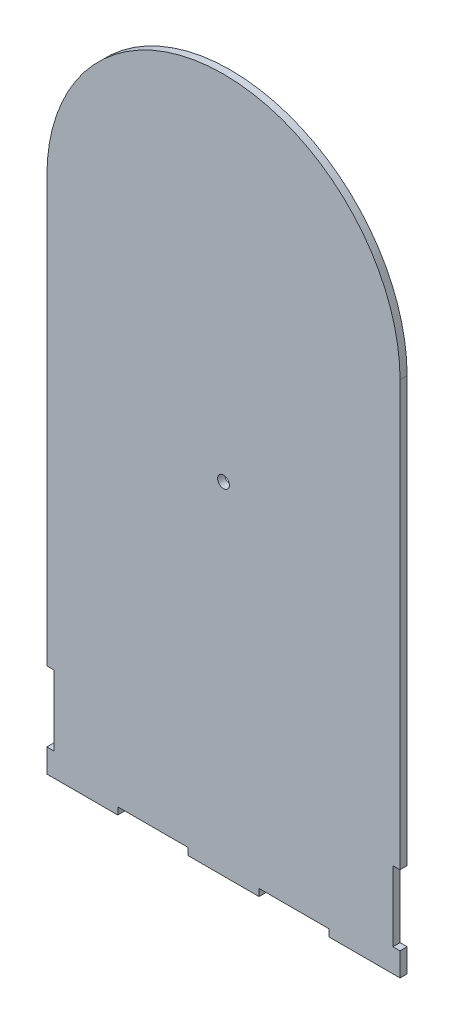
ISO-10303-21;
HEADER;
FILE_DESCRIPTION(('STEP AP214'),'2;1');
FILE_NAME('part.step','',(''),(''),'','','');
FILE_SCHEMA(('AUTOMOTIVE_DESIGN { 1 0 10303 214 1 1 1 1 }'));
ENDSEC;
DATA;
#1=APPLICATION_CONTEXT('core data for automotive mechanical design processes');
#2=APPLICATION_PROTOCOL_DEFINITION('international standard','automotive_design',2000,#1);
#3=PRODUCT_CONTEXT('',#1,'mechanical');
#4=PRODUCT('Part','Part','',(#3));
#5=PRODUCT_RELATED_PRODUCT_CATEGORY('part','',(#4));
#6=PRODUCT_DEFINITION_FORMATION('','',#4);
#7=PRODUCT_DEFINITION_CONTEXT('part definition',#1,'design');
#8=PRODUCT_DEFINITION('design','',#6,#7);
#9=PRODUCT_DEFINITION_SHAPE('','',#8);
#10=(LENGTH_UNIT() NAMED_UNIT(*) SI_UNIT(.MILLI.,.METRE.));
#11=(NAMED_UNIT(*) PLANE_ANGLE_UNIT() SI_UNIT($,.RADIAN.));
#12=(NAMED_UNIT(*) SI_UNIT($,.STERADIAN.) SOLID_ANGLE_UNIT());
#13=UNCERTAINTY_MEASURE_WITH_UNIT(LENGTH_MEASURE(1.E-05),#10,'distance_accuracy_value','');
#14=(GEOMETRIC_REPRESENTATION_CONTEXT(3) GLOBAL_UNCERTAINTY_ASSIGNED_CONTEXT((#13)) GLOBAL_UNIT_ASSIGNED_CONTEXT((#10,
#11,#12)) REPRESENTATION_CONTEXT('',''));
#15=CARTESIAN_POINT('',(0.,0.,0.));
#16=DIRECTION('',(0.,0.,1.));
#17=DIRECTION('',(1.,0.,0.));
#18=AXIS2_PLACEMENT_3D('',#15,#16,#17);
#19=CARTESIAN_POINT('',(150.,0.,3.));
#20=DIRECTION('',(-1.,0.,0.));
#21=DIRECTION('',(0.,-1.,0.));
#22=AXIS2_PLACEMENT_3D('',#19,#20,#21);
#23=PLANE('',#22);
#24=DIRECTION('',(0.,1.,0.));
#25=VECTOR('',#24,1.);
#26=CARTESIAN_POINT('',(150.,0.,0.));
#27=LINE('',#26,#25);
#28=CARTESIAN_POINT('',(150.,39.8,0.));
#29=VERTEX_POINT('',#28);
#30=CARTESIAN_POINT('',(150.,220.,0.));
#31=VERTEX_POINT('',#30);
#32=EDGE_CURVE('E221',#29,#31,#27,.T.);
#33=ORIENTED_EDGE('',*,*,#32,.T.);
#34=DIRECTION('',(0.,0.,-1.));
#35=VECTOR('',#34,1.);
#36=CARTESIAN_POINT('',(150.,220.,3.));
#37=LINE('',#36,#35);
#38=CARTESIAN_POINT('',(150.,220.,3.));
#39=VERTEX_POINT('',#38);
#40=EDGE_CURVE('E11',#39,#31,#37,.T.);
#41=ORIENTED_EDGE('',*,*,#40,.F.);
#42=DIRECTION('',(0.,1.,0.));
#43=VECTOR('',#42,1.);
#44=CARTESIAN_POINT('',(150.,0.,3.));
#45=LINE('',#44,#43);
#46=CARTESIAN_POINT('',(150.,39.8,3.));
#47=VERTEX_POINT('',#46);
#48=EDGE_CURVE('E287',#47,#39,#45,.T.);
#49=ORIENTED_EDGE('',*,*,#48,.F.);
#50=DIRECTION('',(0.,0.,-1.));
#51=VECTOR('',#50,1.);
#52=CARTESIAN_POINT('',(150.,39.8,3.));
#53=LINE('',#52,#51);
#54=EDGE_CURVE('E59',#47,#29,#53,.T.);
#55=ORIENTED_EDGE('',*,*,#54,.T.);
#56=EDGE_LOOP('',(#33,#41,#49,#55));
#57=FACE_BOUND('',#56,.T.);
#58=ADVANCED_FACE('F41',(#57),#23,.F.);
#59=CARTESIAN_POINT('',(75.,220.,3.));
#60=DIRECTION('',(0.,0.,-1.));
#61=DIRECTION('',(-1.,0.,0.));
#62=AXIS2_PLACEMENT_3D('',#59,#60,#61);
#63=CYLINDRICAL_SURFACE('',#62,75.);
#64=CARTESIAN_POINT('',(75.,220.,0.));
#65=DIRECTION('',(0.,0.,1.));
#66=DIRECTION('',(1.,0.,0.));
#67=AXIS2_PLACEMENT_3D('',#64,#65,#66);
#68=CIRCLE('',#67,75.);
#69=CARTESIAN_POINT('',(0.,220.,0.));
#70=VERTEX_POINT('',#69);
#71=EDGE_CURVE('E224',#31,#70,#68,.T.);
#72=ORIENTED_EDGE('',*,*,#71,.T.);
#73=DIRECTION('',(0.,0.,-1.));
#74=VECTOR('',#73,1.);
#75=CARTESIAN_POINT('',(0.,220.,3.));
#76=LINE('',#75,#74);
#77=CARTESIAN_POINT('',(0.,220.,3.));
#78=VERTEX_POINT('',#77);
#79=EDGE_CURVE('E51',#78,#70,#76,.T.);
#80=ORIENTED_EDGE('',*,*,#79,.F.);
#81=CARTESIAN_POINT('',(75.,220.,3.));
#82=DIRECTION('',(0.,0.,1.));
#83=DIRECTION('',(1.,0.,0.));
#84=AXIS2_PLACEMENT_3D('',#81,#82,#83);
#85=CIRCLE('',#84,75.);
#86=EDGE_CURVE('E133',#39,#78,#85,.T.);
#87=ORIENTED_EDGE('',*,*,#86,.F.);
#88=ORIENTED_EDGE('',*,*,#40,.T.);
#89=EDGE_LOOP('',(#72,#80,#87,#88));
#90=FACE_BOUND('',#89,.T.);
#91=ADVANCED_FACE('F43',(#90),#63,.T.);
#92=CARTESIAN_POINT('',(0.,0.,3.));
#93=DIRECTION('',(-1.,0.,0.));
#94=DIRECTION('',(0.,-1.,0.));
#95=AXIS2_PLACEMENT_3D('',#92,#93,#94);
#96=PLANE('',#95);
#97=DIRECTION('',(0.,1.,0.));
#98=VECTOR('',#97,1.);
#99=CARTESIAN_POINT('',(0.,0.,0.));
#100=LINE('',#99,#98);
#101=CARTESIAN_POINT('',(0.,39.8,0.));
#102=VERTEX_POINT('',#101);
#103=EDGE_CURVE('E229',#102,#70,#100,.T.);
#104=ORIENTED_EDGE('',*,*,#103,.F.);
#105=DIRECTION('',(0.,0.,-1.));
#106=VECTOR('',#105,1.);
#107=CARTESIAN_POINT('',(0.,39.8,3.));
#108=LINE('',#107,#106);
#109=CARTESIAN_POINT('',(0.,39.8,3.));
#110=VERTEX_POINT('',#109);
#111=EDGE_CURVE('E339',#110,#102,#108,.T.);
#112=ORIENTED_EDGE('',*,*,#111,.F.);
#113=DIRECTION('',(0.,1.,0.));
#114=VECTOR('',#113,1.);
#115=CARTESIAN_POINT('',(0.,0.,3.));
#116=LINE('',#115,#114);
#117=EDGE_CURVE('E347',#110,#78,#116,.T.);
#118=ORIENTED_EDGE('',*,*,#117,.T.);
#119=ORIENTED_EDGE('',*,*,#79,.T.);
#120=EDGE_LOOP('',(#104,#112,#118,#119));
#121=FACE_BOUND('',#120,.T.);
#122=ADVANCED_FACE('F345',(#121),#96,.T.);
#123=CARTESIAN_POINT('',(0.,39.8,3.));
#124=DIRECTION('',(0.,1.,0.));
#125=DIRECTION('',(0.,0.,1.));
#126=AXIS2_PLACEMENT_3D('',#123,#124,#125);
#127=PLANE('',#126);
#128=DIRECTION('',(1.,0.,0.));
#129=VECTOR('',#128,1.);
#130=CARTESIAN_POINT('',(0.,39.8,0.));
#131=LINE('',#130,#129);
#132=CARTESIAN_POINT('',(2.99999999999998,39.8,0.));
#133=VERTEX_POINT('',#132);
#134=EDGE_CURVE('E233',#102,#133,#131,.T.);
#135=ORIENTED_EDGE('',*,*,#134,.T.);
#136=DIRECTION('',(0.,0.,-1.));
#137=VECTOR('',#136,1.);
#138=CARTESIAN_POINT('',(2.99999999999998,39.8,3.));
#139=LINE('',#138,#137);
#140=CARTESIAN_POINT('',(2.99999999999998,39.8,3.));
#141=VERTEX_POINT('',#140);
#142=EDGE_CURVE('E335',#141,#133,#139,.T.);
#143=ORIENTED_EDGE('',*,*,#142,.F.);
#144=DIRECTION('',(1.,0.,0.));
#145=VECTOR('',#144,1.);
#146=CARTESIAN_POINT('',(0.,39.8,3.));
#147=LINE('',#146,#145);
#148=EDGE_CURVE('E367',#110,#141,#147,.T.);
#149=ORIENTED_EDGE('',*,*,#148,.F.);
#150=ORIENTED_EDGE('',*,*,#111,.T.);
#151=EDGE_LOOP('',(#135,#143,#149,#150));
#152=FACE_BOUND('',#151,.T.);
#153=ADVANCED_FACE('F356',(#152),#127,.F.);
#154=CARTESIAN_POINT('',(3.00000000000001,0.,3.));
#155=DIRECTION('',(1.,0.,0.));
#156=DIRECTION('',(0.,1.,0.));
#157=AXIS2_PLACEMENT_3D('',#154,#155,#156);
#158=PLANE('',#157);
#159=DIRECTION('',(0.,-1.,0.));
#160=VECTOR('',#159,1.);
#161=CARTESIAN_POINT('',(3.00000000000001,0.,0.));
#162=LINE('',#161,#160);
#163=CARTESIAN_POINT('',(3.,10.,0.));
#164=VERTEX_POINT('',#163);
#165=EDGE_CURVE('E237',#133,#164,#162,.T.);
#166=ORIENTED_EDGE('',*,*,#165,.T.);
#167=DIRECTION('',(0.,0.,-1.));
#168=VECTOR('',#167,1.);
#169=CARTESIAN_POINT('',(3.,10.,3.));
#170=LINE('',#169,#168);
#171=CARTESIAN_POINT('',(3.,10.,3.));
#172=VERTEX_POINT('',#171);
#173=EDGE_CURVE('E332',#172,#164,#170,.T.);
#174=ORIENTED_EDGE('',*,*,#173,.F.);
#175=DIRECTION('',(0.,-1.,0.));
#176=VECTOR('',#175,1.);
#177=CARTESIAN_POINT('',(3.00000000000001,0.,3.));
#178=LINE('',#177,#176);
#179=EDGE_CURVE('E362',#141,#172,#178,.T.);
#180=ORIENTED_EDGE('',*,*,#179,.F.);
#181=ORIENTED_EDGE('',*,*,#142,.T.);
#182=EDGE_LOOP('',(#166,#174,#180,#181));
#183=FACE_BOUND('',#182,.T.);
#184=ADVANCED_FACE('F360',(#183),#158,.F.);
#185=CARTESIAN_POINT('',(0.,9.99999999999999,3.));
#186=DIRECTION('',(0.,1.,0.));
#187=DIRECTION('',(-1.,0.,0.));
#188=AXIS2_PLACEMENT_3D('',#185,#186,#187);
#189=PLANE('',#188);
#190=DIRECTION('',(1.,0.,0.));
#191=VECTOR('',#190,1.);
#192=CARTESIAN_POINT('',(0.,9.99999999999999,0.));
#193=LINE('',#192,#191);
#194=CARTESIAN_POINT('',(0.,10.,0.));
#195=VERTEX_POINT('',#194);
#196=EDGE_CURVE('E241',#195,#164,#193,.T.);
#197=ORIENTED_EDGE('',*,*,#196,.F.);
#198=DIRECTION('',(0.,0.,-1.));
#199=VECTOR('',#198,1.);
#200=CARTESIAN_POINT('',(0.,10.,3.));
#201=LINE('',#200,#199);
#202=CARTESIAN_POINT('',(0.,10.,3.));
#203=VERTEX_POINT('',#202);
#204=EDGE_CURVE('E329',#203,#195,#201,.T.);
#205=ORIENTED_EDGE('',*,*,#204,.F.);
#206=DIRECTION('',(1.,0.,0.));
#207=VECTOR('',#206,1.);
#208=CARTESIAN_POINT('',(0.,9.99999999999999,3.));
#209=LINE('',#208,#207);
#210=EDGE_CURVE('E366',#203,#172,#209,.T.);
#211=ORIENTED_EDGE('',*,*,#210,.T.);
#212=ORIENTED_EDGE('',*,*,#173,.T.);
#213=EDGE_LOOP('',(#197,#205,#211,#212));
#214=FACE_BOUND('',#213,.T.);
#215=ADVANCED_FACE('F420',(#214),#189,.T.);
#216=CARTESIAN_POINT('',(0.,0.,0.));
#217=VERTEX_POINT('',#216);
#218=EDGE_CURVE('E234',#217,#195,#100,.T.);
#219=ORIENTED_EDGE('',*,*,#218,.F.);
#220=DIRECTION('',(0.,0.,-1.));
#221=VECTOR('',#220,1.);
#222=CARTESIAN_POINT('',(0.,0.,3.));
#223=LINE('',#222,#221);
#224=CARTESIAN_POINT('',(0.,0.,3.));
#225=VERTEX_POINT('',#224);
#226=EDGE_CURVE('E326',#225,#217,#223,.T.);
#227=ORIENTED_EDGE('',*,*,#226,.F.);
#228=EDGE_CURVE('E371',#225,#203,#116,.T.);
#229=ORIENTED_EDGE('',*,*,#228,.T.);
#230=ORIENTED_EDGE('',*,*,#204,.T.);
#231=EDGE_LOOP('',(#219,#227,#229,#230));
#232=FACE_BOUND('',#231,.T.);
#233=ADVANCED_FACE('F415',(#232),#96,.T.);
#234=CARTESIAN_POINT('',(0.,0.,3.));
#235=DIRECTION('',(0.,1.,0.));
#236=DIRECTION('',(0.,0.,1.));
#237=AXIS2_PLACEMENT_3D('',#234,#235,#236);
#238=PLANE('',#237);
#239=DIRECTION('',(1.,0.,0.));
#240=VECTOR('',#239,1.);
#241=CARTESIAN_POINT('',(0.,0.,0.));
#242=LINE('',#241,#240);
#243=CARTESIAN_POINT('',(30.1,0.,0.));
#244=VERTEX_POINT('',#243);
#245=EDGE_CURVE('E245',#217,#244,#242,.T.);
#246=ORIENTED_EDGE('',*,*,#245,.T.);
#247=DIRECTION('',(0.,0.,-1.));
#248=VECTOR('',#247,1.);
#249=CARTESIAN_POINT('',(30.1,0.,3.));
#250=LINE('',#249,#248);
#251=CARTESIAN_POINT('',(30.1,0.,3.));
#252=VERTEX_POINT('',#251);
#253=EDGE_CURVE('E322',#252,#244,#250,.T.);
#254=ORIENTED_EDGE('',*,*,#253,.F.);
#255=DIRECTION('',(1.,0.,0.));
#256=VECTOR('',#255,1.);
#257=CARTESIAN_POINT('',(0.,0.,3.));
#258=LINE('',#257,#256);
#259=EDGE_CURVE('E376',#225,#252,#258,.T.);
#260=ORIENTED_EDGE('',*,*,#259,.F.);
#261=ORIENTED_EDGE('',*,*,#226,.T.);
#262=EDGE_LOOP('',(#246,#254,#260,#261));
#263=FACE_BOUND('',#262,.T.);
#264=ADVANCED_FACE('F476',(#263),#238,.F.);
#265=CARTESIAN_POINT('',(30.1,0.,3.));
#266=DIRECTION('',(-1.,0.,0.));
#267=DIRECTION('',(0.,0.,1.));
#268=AXIS2_PLACEMENT_3D('',#265,#266,#267);
#269=PLANE('',#268);
#270=DIRECTION('',(0.,1.,0.));
#271=VECTOR('',#270,1.);
#272=CARTESIAN_POINT('',(30.1,0.,0.));
#273=LINE('',#272,#271);
#274=CARTESIAN_POINT('',(30.1,3.,0.));
#275=VERTEX_POINT('',#274);
#276=EDGE_CURVE('E248',#244,#275,#273,.T.);
#277=ORIENTED_EDGE('',*,*,#276,.T.);
#278=DIRECTION('',(0.,0.,-1.));
#279=VECTOR('',#278,1.);
#280=CARTESIAN_POINT('',(30.1,3.,3.));
#281=LINE('',#280,#279);
#282=CARTESIAN_POINT('',(30.1,3.,3.));
#283=VERTEX_POINT('',#282);
#284=EDGE_CURVE('E318',#283,#275,#281,.T.);
#285=ORIENTED_EDGE('',*,*,#284,.F.);
#286=DIRECTION('',(0.,1.,0.));
#287=VECTOR('',#286,1.);
#288=CARTESIAN_POINT('',(30.1,0.,3.));
#289=LINE('',#288,#287);
#290=EDGE_CURVE('E379',#252,#283,#289,.T.);
#291=ORIENTED_EDGE('',*,*,#290,.F.);
#292=ORIENTED_EDGE('',*,*,#253,.T.);
#293=EDGE_LOOP('',(#277,#285,#291,#292));
#294=FACE_BOUND('',#293,.T.);
#295=ADVANCED_FACE('F483',(#294),#269,.F.);
#296=CARTESIAN_POINT('',(0.,3.,3.));
#297=DIRECTION('',(0.,1.,0.));
#298=DIRECTION('',(0.,0.,1.));
#299=AXIS2_PLACEMENT_3D('',#296,#297,#298);
#300=PLANE('',#299);
#301=DIRECTION('',(1.,0.,0.));
#302=VECTOR('',#301,1.);
#303=CARTESIAN_POINT('',(0.,3.,0.));
#304=LINE('',#303,#302);
#305=CARTESIAN_POINT('',(59.9,3.,0.));
#306=VERTEX_POINT('',#305);
#307=EDGE_CURVE('E252',#275,#306,#304,.T.);
#308=ORIENTED_EDGE('',*,*,#307,.T.);
#309=DIRECTION('',(0.,0.,-1.));
#310=VECTOR('',#309,1.);
#311=CARTESIAN_POINT('',(59.9,3.,3.));
#312=LINE('',#311,#310);
#313=CARTESIAN_POINT('',(59.9,3.,3.));
#314=VERTEX_POINT('',#313);
#315=EDGE_CURVE('E315',#314,#306,#312,.T.);
#316=ORIENTED_EDGE('',*,*,#315,.F.);
#317=DIRECTION('',(1.,0.,0.));
#318=VECTOR('',#317,1.);
#319=CARTESIAN_POINT('',(0.,3.,3.));
#320=LINE('',#319,#318);
#321=EDGE_CURVE('E383',#283,#314,#320,.T.);
#322=ORIENTED_EDGE('',*,*,#321,.F.);
#323=ORIENTED_EDGE('',*,*,#284,.T.);
#324=EDGE_LOOP('',(#308,#316,#322,#323));
#325=FACE_BOUND('',#324,.T.);
#326=ADVANCED_FACE('F479',(#325),#300,.F.);
#327=CARTESIAN_POINT('',(59.9,0.,3.));
#328=DIRECTION('',(-1.,0.,0.));
#329=DIRECTION('',(0.,0.,1.));
#330=AXIS2_PLACEMENT_3D('',#327,#328,#329);
#331=PLANE('',#330);
#332=DIRECTION('',(0.,1.,0.));
#333=VECTOR('',#332,1.);
#334=CARTESIAN_POINT('',(59.9,0.,0.));
#335=LINE('',#334,#333);
#336=CARTESIAN_POINT('',(59.9,0.,0.));
#337=VERTEX_POINT('',#336);
#338=EDGE_CURVE('E256',#337,#306,#335,.T.);
#339=ORIENTED_EDGE('',*,*,#338,.F.);
#340=DIRECTION('',(0.,0.,-1.));
#341=VECTOR('',#340,1.);
#342=CARTESIAN_POINT('',(59.9,0.,3.));
#343=LINE('',#342,#341);
#344=CARTESIAN_POINT('',(59.9,0.,3.));
#345=VERTEX_POINT('',#344);
#346=EDGE_CURVE('E312',#345,#337,#343,.T.);
#347=ORIENTED_EDGE('',*,*,#346,.F.);
#348=DIRECTION('',(0.,1.,0.));
#349=VECTOR('',#348,1.);
#350=CARTESIAN_POINT('',(59.9,0.,3.));
#351=LINE('',#350,#349);
#352=EDGE_CURVE('E386',#345,#314,#351,.T.);
#353=ORIENTED_EDGE('',*,*,#352,.T.);
#354=ORIENTED_EDGE('',*,*,#315,.T.);
#355=EDGE_LOOP('',(#339,#347,#353,#354));
#356=FACE_BOUND('',#355,.T.);
#357=ADVANCED_FACE('F474',(#356),#331,.T.);
#358=CARTESIAN_POINT('',(90.1,0.,0.));
#359=VERTEX_POINT('',#358);
#360=EDGE_CURVE('E249',#337,#359,#242,.T.);
#361=ORIENTED_EDGE('',*,*,#360,.T.);
#362=DIRECTION('',(0.,0.,-1.));
#363=VECTOR('',#362,1.);
#364=CARTESIAN_POINT('',(90.1,0.,3.));
#365=LINE('',#364,#363);
#366=CARTESIAN_POINT('',(90.1,0.,3.));
#367=VERTEX_POINT('',#366);
#368=EDGE_CURVE('E308',#367,#359,#365,.T.);
#369=ORIENTED_EDGE('',*,*,#368,.F.);
#370=EDGE_CURVE('E380',#345,#367,#258,.T.);
#371=ORIENTED_EDGE('',*,*,#370,.F.);
#372=ORIENTED_EDGE('',*,*,#346,.T.);
#373=EDGE_LOOP('',(#361,#369,#371,#372));
#374=FACE_BOUND('',#373,.T.);
#375=ADVANCED_FACE('F470',(#374),#238,.F.);
#376=CARTESIAN_POINT('',(90.1,0.,3.));
#377=DIRECTION('',(-1.,0.,0.));
#378=DIRECTION('',(0.,0.,1.));
#379=AXIS2_PLACEMENT_3D('',#376,#377,#378);
#380=PLANE('',#379);
#381=DIRECTION('',(0.,1.,0.));
#382=VECTOR('',#381,1.);
#383=CARTESIAN_POINT('',(90.1,0.,0.));
#384=LINE('',#383,#382);
#385=CARTESIAN_POINT('',(90.1,3.,0.));
#386=VERTEX_POINT('',#385);
#387=EDGE_CURVE('E260',#359,#386,#384,.T.);
#388=ORIENTED_EDGE('',*,*,#387,.T.);
#389=DIRECTION('',(0.,0.,-1.));
#390=VECTOR('',#389,1.);
#391=CARTESIAN_POINT('',(90.1,3.,3.));
#392=LINE('',#391,#390);
#393=CARTESIAN_POINT('',(90.1,3.,3.));
#394=VERTEX_POINT('',#393);
#395=EDGE_CURVE('E304',#394,#386,#392,.T.);
#396=ORIENTED_EDGE('',*,*,#395,.F.);
#397=DIRECTION('',(0.,1.,0.));
#398=VECTOR('',#397,1.);
#399=CARTESIAN_POINT('',(90.1,0.,3.));
#400=LINE('',#399,#398);
#401=EDGE_CURVE('E390',#367,#394,#400,.T.);
#402=ORIENTED_EDGE('',*,*,#401,.F.);
#403=ORIENTED_EDGE('',*,*,#368,.T.);
#404=EDGE_LOOP('',(#388,#396,#402,#403));
#405=FACE_BOUND('',#404,.T.);
#406=ADVANCED_FACE('F466',(#405),#380,.F.);
#407=CARTESIAN_POINT('',(0.,3.,3.));
#408=DIRECTION('',(0.,1.,0.));
#409=DIRECTION('',(0.,0.,1.));
#410=AXIS2_PLACEMENT_3D('',#407,#408,#409);
#411=PLANE('',#410);
#412=DIRECTION('',(1.,0.,0.));
#413=VECTOR('',#412,1.);
#414=CARTESIAN_POINT('',(0.,3.,0.));
#415=LINE('',#414,#413);
#416=CARTESIAN_POINT('',(119.9,3.,0.));
#417=VERTEX_POINT('',#416);
#418=EDGE_CURVE('E263',#386,#417,#415,.T.);
#419=ORIENTED_EDGE('',*,*,#418,.T.);
#420=DIRECTION('',(0.,0.,-1.));
#421=VECTOR('',#420,1.);
#422=CARTESIAN_POINT('',(119.9,3.,3.));
#423=LINE('',#422,#421);
#424=CARTESIAN_POINT('',(119.9,3.,3.));
#425=VERTEX_POINT('',#424);
#426=EDGE_CURVE('E301',#425,#417,#423,.T.);
#427=ORIENTED_EDGE('',*,*,#426,.F.);
#428=DIRECTION('',(1.,0.,0.));
#429=VECTOR('',#428,1.);
#430=CARTESIAN_POINT('',(0.,3.,3.));
#431=LINE('',#430,#429);
#432=EDGE_CURVE('E393',#394,#425,#431,.T.);
#433=ORIENTED_EDGE('',*,*,#432,.F.);
#434=ORIENTED_EDGE('',*,*,#395,.T.);
#435=EDGE_LOOP('',(#419,#427,#433,#434));
#436=FACE_BOUND('',#435,.T.);
#437=ADVANCED_FACE('F460',(#436),#411,.F.);
#438=CARTESIAN_POINT('',(119.9,0.,3.));
#439=DIRECTION('',(-1.,0.,0.));
#440=DIRECTION('',(0.,0.,1.));
#441=AXIS2_PLACEMENT_3D('',#438,#439,#440);
#442=PLANE('',#441);
#443=DIRECTION('',(0.,1.,0.));
#444=VECTOR('',#443,1.);
#445=CARTESIAN_POINT('',(119.9,0.,0.));
#446=LINE('',#445,#444);
#447=CARTESIAN_POINT('',(119.9,0.,0.));
#448=VERTEX_POINT('',#447);
#449=EDGE_CURVE('E267',#448,#417,#446,.T.);
#450=ORIENTED_EDGE('',*,*,#449,.F.);
#451=DIRECTION('',(0.,0.,-1.));
#452=VECTOR('',#451,1.);
#453=CARTESIAN_POINT('',(119.9,0.,3.));
#454=LINE('',#453,#452);
#455=CARTESIAN_POINT('',(119.9,0.,3.));
#456=VERTEX_POINT('',#455);
#457=EDGE_CURVE('E298',#456,#448,#454,.T.);
#458=ORIENTED_EDGE('',*,*,#457,.F.);
#459=DIRECTION('',(0.,1.,0.));
#460=VECTOR('',#459,1.);
#461=CARTESIAN_POINT('',(119.9,0.,3.));
#462=LINE('',#461,#460);
#463=EDGE_CURVE('E396',#456,#425,#462,.T.);
#464=ORIENTED_EDGE('',*,*,#463,.T.);
#465=ORIENTED_EDGE('',*,*,#426,.T.);
#466=EDGE_LOOP('',(#450,#458,#464,#465));
#467=FACE_BOUND('',#466,.T.);
#468=ADVANCED_FACE('F455',(#467),#442,.T.);
#469=CARTESIAN_POINT('',(0.,0.,3.));
#470=DIRECTION('',(0.,1.,0.));
#471=DIRECTION('',(0.,0.,1.));
#472=AXIS2_PLACEMENT_3D('',#469,#470,#471);
#473=PLANE('',#472);
#474=DIRECTION('',(1.,0.,0.));
#475=VECTOR('',#474,1.);
#476=CARTESIAN_POINT('',(0.,0.,0.));
#477=LINE('',#476,#475);
#478=CARTESIAN_POINT('',(150.,0.,0.));
#479=VERTEX_POINT('',#478);
#480=EDGE_CURVE('E271',#448,#479,#477,.T.);
#481=ORIENTED_EDGE('',*,*,#480,.T.);
#482=DIRECTION('',(0.,0.,-1.));
#483=VECTOR('',#482,1.);
#484=CARTESIAN_POINT('',(150.,0.,3.));
#485=LINE('',#484,#483);
#486=CARTESIAN_POINT('',(150.,0.,3.));
#487=VERTEX_POINT('',#486);
#488=EDGE_CURVE('E294',#487,#479,#485,.T.);
#489=ORIENTED_EDGE('',*,*,#488,.F.);
#490=DIRECTION('',(1.,0.,0.));
#491=VECTOR('',#490,1.);
#492=CARTESIAN_POINT('',(0.,0.,3.));
#493=LINE('',#492,#491);
#494=EDGE_CURVE('E399',#456,#487,#493,.T.);
#495=ORIENTED_EDGE('',*,*,#494,.F.);
#496=ORIENTED_EDGE('',*,*,#457,.T.);
#497=EDGE_LOOP('',(#481,#489,#495,#496));
#498=FACE_BOUND('',#497,.T.);
#499=ADVANCED_FACE('F450',(#498),#473,.F.);
#500=CARTESIAN_POINT('',(150.,9.99999999999999,0.));
#501=VERTEX_POINT('',#500);
#502=EDGE_CURVE('E225',#479,#501,#27,.T.);
#503=ORIENTED_EDGE('',*,*,#502,.T.);
#504=DIRECTION('',(0.,0.,-1.));
#505=VECTOR('',#504,1.);
#506=CARTESIAN_POINT('',(150.,9.99999999999999,3.));
#507=LINE('',#506,#505);
#508=CARTESIAN_POINT('',(150.,9.99999999999999,3.));
#509=VERTEX_POINT('',#508);
#510=EDGE_CURVE('E207',#509,#501,#507,.T.);
#511=ORIENTED_EDGE('',*,*,#510,.F.);
#512=EDGE_CURVE('E193',#487,#509,#45,.T.);
#513=ORIENTED_EDGE('',*,*,#512,.F.);
#514=ORIENTED_EDGE('',*,*,#488,.T.);
#515=EDGE_LOOP('',(#503,#511,#513,#514));
#516=FACE_BOUND('',#515,.T.);
#517=ADVANCED_FACE('F429',(#516),#23,.F.);
#518=CARTESIAN_POINT('',(0.,10.000000000001,3.));
#519=DIRECTION('',(0.,-1.,0.));
#520=DIRECTION('',(1.,0.,0.));
#521=AXIS2_PLACEMENT_3D('',#518,#519,#520);
#522=PLANE('',#521);
#523=DIRECTION('',(-1.,0.,0.));
#524=VECTOR('',#523,1.);
#525=CARTESIAN_POINT('',(0.,10.000000000001,0.));
#526=LINE('',#525,#524);
#527=CARTESIAN_POINT('',(147.,10.,0.));
#528=VERTEX_POINT('',#527);
#529=EDGE_CURVE('E203',#501,#528,#526,.T.);
#530=ORIENTED_EDGE('',*,*,#529,.T.);
#531=DIRECTION('',(0.,0.,-1.));
#532=VECTOR('',#531,1.);
#533=CARTESIAN_POINT('',(147.,10.,3.));
#534=LINE('',#533,#532);
#535=CARTESIAN_POINT('',(147.,10.,3.));
#536=VERTEX_POINT('',#535);
#537=EDGE_CURVE('E200',#536,#528,#534,.T.);
#538=ORIENTED_EDGE('',*,*,#537,.F.);
#539=DIRECTION('',(-1.,0.,0.));
#540=VECTOR('',#539,1.);
#541=CARTESIAN_POINT('',(0.,10.000000000001,3.));
#542=LINE('',#541,#540);
#543=EDGE_CURVE('E185',#509,#536,#542,.T.);
#544=ORIENTED_EDGE('',*,*,#543,.F.);
#545=ORIENTED_EDGE('',*,*,#510,.T.);
#546=EDGE_LOOP('',(#530,#538,#544,#545));
#547=FACE_BOUND('',#546,.T.);
#548=ADVANCED_FACE('F201',(#547),#522,.F.);
#549=CARTESIAN_POINT('',(147.,-1.36915087768371E-13,3.));
#550=DIRECTION('',(1.,0.,0.));
#551=DIRECTION('',(0.,1.,0.));
#552=AXIS2_PLACEMENT_3D('',#549,#550,#551);
#553=PLANE('',#552);
#554=DIRECTION('',(0.,-1.,0.));
#555=VECTOR('',#554,1.);
#556=CARTESIAN_POINT('',(147.,-1.36915087768371E-13,0.));
#557=LINE('',#556,#555);
#558=CARTESIAN_POINT('',(147.,39.8,0.));
#559=VERTEX_POINT('',#558);
#560=EDGE_CURVE('E276',#559,#528,#557,.T.);
#561=ORIENTED_EDGE('',*,*,#560,.F.);
#562=DIRECTION('',(0.,0.,-1.));
#563=VECTOR('',#562,1.);
#564=CARTESIAN_POINT('',(147.,39.8,3.));
#565=LINE('',#564,#563);
#566=CARTESIAN_POINT('',(147.,39.8,3.));
#567=VERTEX_POINT('',#566);
#568=EDGE_CURVE('E121',#567,#559,#565,.T.);
#569=ORIENTED_EDGE('',*,*,#568,.F.);
#570=DIRECTION('',(0.,-1.,0.));
#571=VECTOR('',#570,1.);
#572=CARTESIAN_POINT('',(147.,-1.36915087768371E-13,3.));
#573=LINE('',#572,#571);
#574=EDGE_CURVE('E191',#567,#536,#573,.T.);
#575=ORIENTED_EDGE('',*,*,#574,.T.);
#576=ORIENTED_EDGE('',*,*,#537,.T.);
#577=EDGE_LOOP('',(#561,#569,#575,#576));
#578=FACE_BOUND('',#577,.T.);
#579=ADVANCED_FACE('F209',(#578),#553,.T.);
#580=CARTESIAN_POINT('',(0.,39.8,3.));
#581=DIRECTION('',(0.,-1.,0.));
#582=DIRECTION('',(0.,0.,-1.));
#583=AXIS2_PLACEMENT_3D('',#580,#581,#582);
#584=PLANE('',#583);
#585=DIRECTION('',(-1.,0.,0.));
#586=VECTOR('',#585,1.);
#587=CARTESIAN_POINT('',(0.,39.8,0.));
#588=LINE('',#587,#586);
#589=EDGE_CURVE('E279',#29,#559,#588,.T.);
#590=ORIENTED_EDGE('',*,*,#589,.F.);
#591=ORIENTED_EDGE('',*,*,#54,.F.);
#592=DIRECTION('',(-1.,0.,0.));
#593=VECTOR('',#592,1.);
#594=CARTESIAN_POINT('',(0.,39.8,3.));
#595=LINE('',#594,#593);
#596=EDGE_CURVE('E211',#47,#567,#595,.T.);
#597=ORIENTED_EDGE('',*,*,#596,.T.);
#598=ORIENTED_EDGE('',*,*,#568,.T.);
#599=EDGE_LOOP('',(#590,#591,#597,#598));
#600=FACE_BOUND('',#599,.T.);
#601=ADVANCED_FACE('F431',(#600),#584,.T.);
#602=CARTESIAN_POINT('',(75.,145.,3.));
#603=DIRECTION('',(0.,0.,-1.));
#604=DIRECTION('',(-1.,0.,0.));
#605=AXIS2_PLACEMENT_3D('',#602,#603,#604);
#606=CYLINDRICAL_SURFACE('',#605,2.50000000000001);
#607=CARTESIAN_POINT('',(75.,145.,3.));
#608=DIRECTION('',(0.,0.,1.));
#609=DIRECTION('',(1.,0.,0.));
#610=AXIS2_PLACEMENT_3D('',#607,#608,#609);
#611=CIRCLE('',#610,2.50000000000001);
#612=CARTESIAN_POINT('',(77.5,145.,3.));
#613=VERTEX_POINT('',#612);
#614=EDGE_CURVE('E214',#613,#613,#611,.T.);
#615=ORIENTED_EDGE('',*,*,#614,.T.);
#616=EDGE_LOOP('',(#615));
#617=FACE_BOUND('',#616,.T.);
#618=CARTESIAN_POINT('',(75.,145.,0.));
#619=DIRECTION('',(0.,0.,1.));
#620=DIRECTION('',(1.,0.,0.));
#621=AXIS2_PLACEMENT_3D('',#618,#619,#620);
#622=CIRCLE('',#621,2.50000000000001);
#623=CARTESIAN_POINT('',(77.5,145.,0.));
#624=VERTEX_POINT('',#623);
#625=EDGE_CURVE('E283',#624,#624,#622,.T.);
#626=ORIENTED_EDGE('',*,*,#625,.F.);
#627=EDGE_LOOP('',(#626));
#628=FACE_BOUND('',#627,.T.);
#629=ADVANCED_FACE('F433',(#617,#628),#606,.F.);
#630=CARTESIAN_POINT('',(0.,0.,3.));
#631=DIRECTION('',(0.,0.,1.));
#632=DIRECTION('',(1.,0.,0.));
#633=AXIS2_PLACEMENT_3D('',#630,#631,#632);
#634=PLANE('',#633);
#635=ORIENTED_EDGE('',*,*,#48,.T.);
#636=ORIENTED_EDGE('',*,*,#86,.T.);
#637=ORIENTED_EDGE('',*,*,#117,.F.);
#638=ORIENTED_EDGE('',*,*,#148,.T.);
#639=ORIENTED_EDGE('',*,*,#179,.T.);
#640=ORIENTED_EDGE('',*,*,#210,.F.);
#641=ORIENTED_EDGE('',*,*,#228,.F.);
#642=ORIENTED_EDGE('',*,*,#259,.T.);
#643=ORIENTED_EDGE('',*,*,#290,.T.);
#644=ORIENTED_EDGE('',*,*,#321,.T.);
#645=ORIENTED_EDGE('',*,*,#352,.F.);
#646=ORIENTED_EDGE('',*,*,#370,.T.);
#647=ORIENTED_EDGE('',*,*,#401,.T.);
#648=ORIENTED_EDGE('',*,*,#432,.T.);
#649=ORIENTED_EDGE('',*,*,#463,.F.);
#650=ORIENTED_EDGE('',*,*,#494,.T.);
#651=ORIENTED_EDGE('',*,*,#512,.T.);
#652=ORIENTED_EDGE('',*,*,#543,.T.);
#653=ORIENTED_EDGE('',*,*,#574,.F.);
#654=ORIENTED_EDGE('',*,*,#596,.F.);
#655=EDGE_LOOP('',(#635,#636,#637,#638,#639,#640,#641,#642,#643,#644,#645,#646,#647,#648,#649,
#650,#651,#652,#653,#654));
#656=FACE_BOUND('',#655,.T.);
#657=ORIENTED_EDGE('',*,*,#614,.F.);
#658=EDGE_LOOP('',(#657));
#659=FACE_BOUND('',#658,.T.);
#660=ADVANCED_FACE('F187',(#656,#659),#634,.T.);
#661=CARTESIAN_POINT('',(0.,0.,0.));
#662=DIRECTION('',(0.,0.,1.));
#663=DIRECTION('',(1.,0.,0.));
#664=AXIS2_PLACEMENT_3D('',#661,#662,#663);
#665=PLANE('',#664);
#666=ORIENTED_EDGE('',*,*,#32,.F.);
#667=ORIENTED_EDGE('',*,*,#589,.T.);
#668=ORIENTED_EDGE('',*,*,#560,.T.);
#669=ORIENTED_EDGE('',*,*,#529,.F.);
#670=ORIENTED_EDGE('',*,*,#502,.F.);
#671=ORIENTED_EDGE('',*,*,#480,.F.);
#672=ORIENTED_EDGE('',*,*,#449,.T.);
#673=ORIENTED_EDGE('',*,*,#418,.F.);
#674=ORIENTED_EDGE('',*,*,#387,.F.);
#675=ORIENTED_EDGE('',*,*,#360,.F.);
#676=ORIENTED_EDGE('',*,*,#338,.T.);
#677=ORIENTED_EDGE('',*,*,#307,.F.);
#678=ORIENTED_EDGE('',*,*,#276,.F.);
#679=ORIENTED_EDGE('',*,*,#245,.F.);
#680=ORIENTED_EDGE('',*,*,#218,.T.);
#681=ORIENTED_EDGE('',*,*,#196,.T.);
#682=ORIENTED_EDGE('',*,*,#165,.F.);
#683=ORIENTED_EDGE('',*,*,#134,.F.);
#684=ORIENTED_EDGE('',*,*,#103,.T.);
#685=ORIENTED_EDGE('',*,*,#71,.F.);
#686=EDGE_LOOP('',(#666,#667,#668,#669,#670,#671,#672,#673,#674,#675,#676,#677,#678,#679,#680,
#681,#682,#683,#684,#685));
#687=FACE_BOUND('',#686,.T.);
#688=ORIENTED_EDGE('',*,*,#625,.T.);
#689=EDGE_LOOP('',(#688));
#690=FACE_BOUND('',#689,.T.);
#691=ADVANCED_FACE('F351',(#687,#690),#665,.F.);
#692=CLOSED_SHELL('',(#58,#91,#122,#153,#184,#215,#233,#264,#295,#326,#357,#375,#406,#437,#468,
#499,#517,#548,#579,#601,#629,#660,#691));
#693=MANIFOLD_SOLID_BREP('B2',#692);
#694=ADVANCED_BREP_SHAPE_REPRESENTATION('',(#18,#693),#14);
#695=SHAPE_DEFINITION_REPRESENTATION(#9,#694);
ENDSEC;
END-ISO-10303-21;
